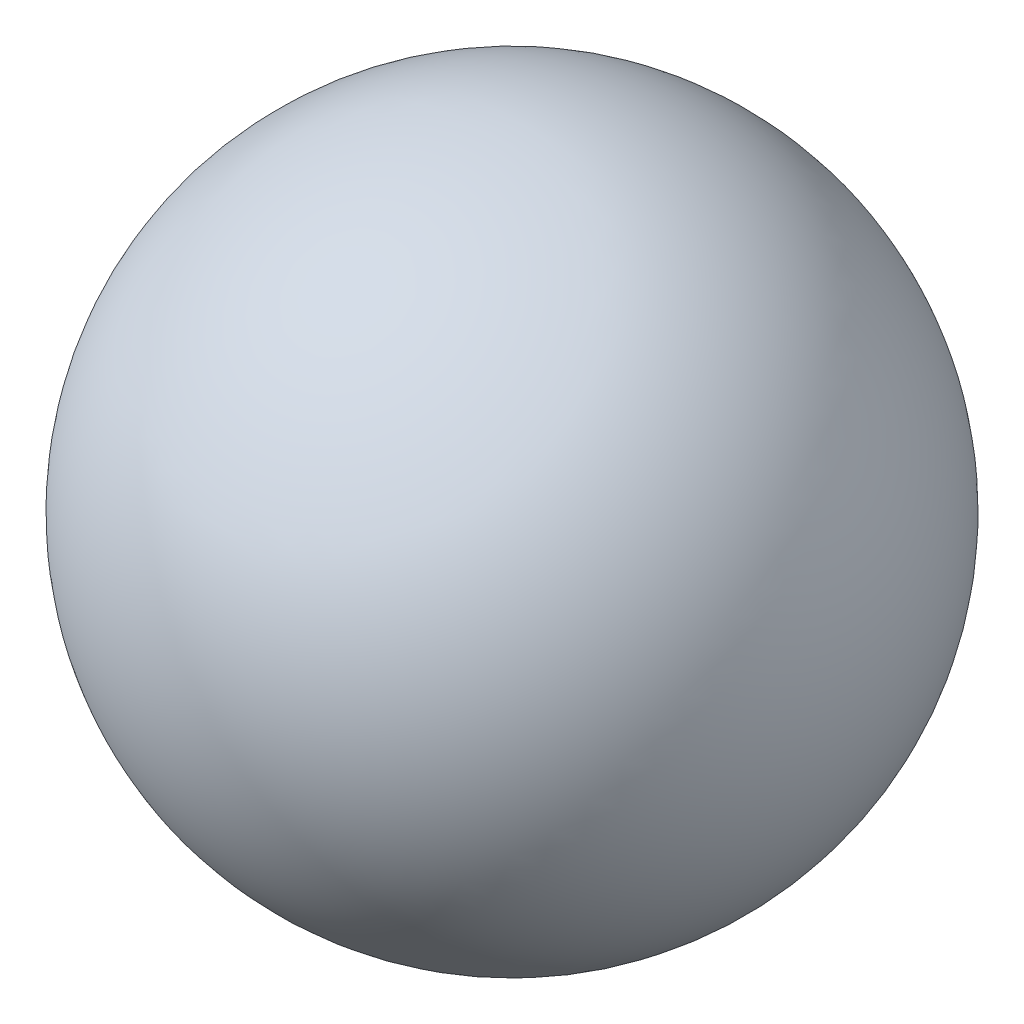
ISO-10303-21;
HEADER;
FILE_DESCRIPTION(('STEP AP214'),'2;1');
FILE_NAME('part.step','',(''),(''),'','','');
FILE_SCHEMA(('AUTOMOTIVE_DESIGN { 1 0 10303 214 1 1 1 1 }'));
ENDSEC;
DATA;
#1=APPLICATION_CONTEXT('core data for automotive mechanical design processes');
#2=APPLICATION_PROTOCOL_DEFINITION('international standard','automotive_design',2000,#1);
#3=PRODUCT_CONTEXT('',#1,'mechanical');
#4=PRODUCT('Part','Part','',(#3));
#5=PRODUCT_RELATED_PRODUCT_CATEGORY('part','',(#4));
#6=PRODUCT_DEFINITION_FORMATION('','',#4);
#7=PRODUCT_DEFINITION_CONTEXT('part definition',#1,'design');
#8=PRODUCT_DEFINITION('design','',#6,#7);
#9=PRODUCT_DEFINITION_SHAPE('','',#8);
#10=(LENGTH_UNIT() NAMED_UNIT(*) SI_UNIT(.MILLI.,.METRE.));
#11=(NAMED_UNIT(*) PLANE_ANGLE_UNIT() SI_UNIT($,.RADIAN.));
#12=(NAMED_UNIT(*) SI_UNIT($,.STERADIAN.) SOLID_ANGLE_UNIT());
#13=UNCERTAINTY_MEASURE_WITH_UNIT(LENGTH_MEASURE(1.E-05),#10,'distance_accuracy_value','');
#14=(GEOMETRIC_REPRESENTATION_CONTEXT(3) GLOBAL_UNCERTAINTY_ASSIGNED_CONTEXT((#13)) GLOBAL_UNIT_ASSIGNED_CONTEXT((#10,
#11,#12)) REPRESENTATION_CONTEXT('',''));
#15=CARTESIAN_POINT('',(0.,0.,0.));
#16=DIRECTION('',(0.,0.,1.));
#17=DIRECTION('',(1.,0.,0.));
#18=AXIS2_PLACEMENT_3D('',#15,#16,#17);
#19=CARTESIAN_POINT('',(-8.88005749866254,-2.,-7.69461362385709));
#20=DIRECTION('',(0.,0.,1.));
#21=DIRECTION('',(1.,0.,0.));
#22=AXIS2_PLACEMENT_3D('',#19,#20,#21);
#23=SPHERICAL_SURFACE('',#22,1.05);
#24=CARTESIAN_POINT('',(-8.88005749866254,-2.,-6.64461362385709));
#25=VERTEX_POINT('',#24);
#26=VERTEX_LOOP('',#25);
#27=FACE_BOUND('',#26,.T.);
#28=ADVANCED_FACE('F12',(#27),#23,.T.);
#29=CLOSED_SHELL('',(#28));
#30=MANIFOLD_SOLID_BREP('B1',#29);
#31=ADVANCED_BREP_SHAPE_REPRESENTATION('',(#18,#30),#14);
#32=SHAPE_DEFINITION_REPRESENTATION(#9,#31);
ENDSEC;
END-ISO-10303-21;
